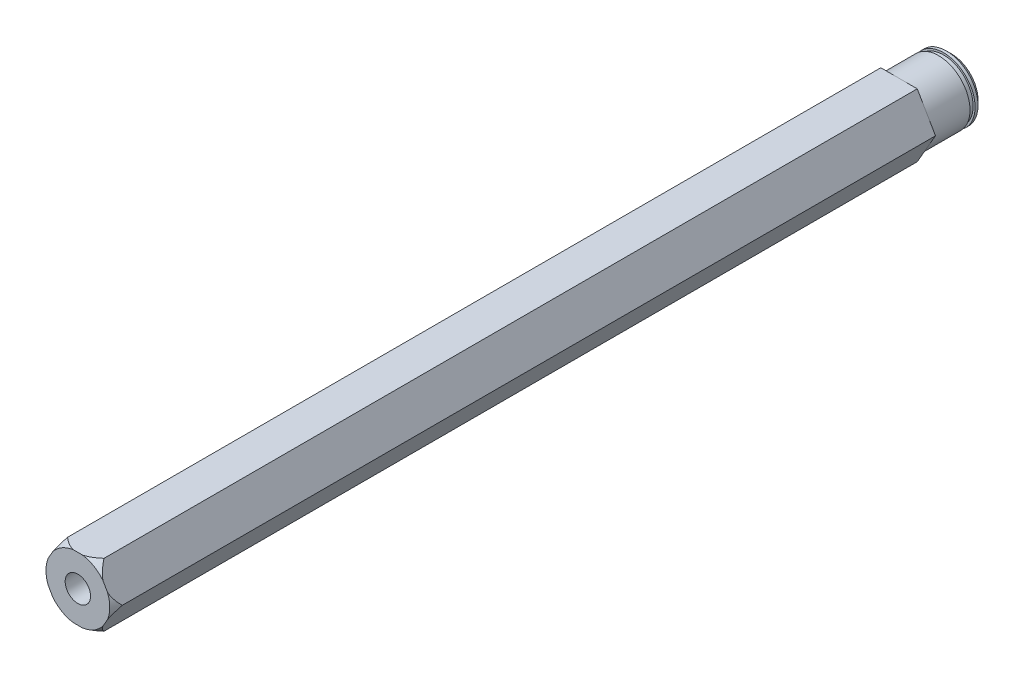
ISO-10303-21;
HEADER;
FILE_DESCRIPTION(('STEP AP214'),'2;1');
FILE_NAME('part.step','',(''),(''),'','','');
FILE_SCHEMA(('AUTOMOTIVE_DESIGN { 1 0 10303 214 1 1 1 1 }'));
ENDSEC;
DATA;
#1=APPLICATION_CONTEXT('core data for automotive mechanical design processes');
#2=APPLICATION_PROTOCOL_DEFINITION('international standard','automotive_design',2000,#1);
#3=PRODUCT_CONTEXT('',#1,'mechanical');
#4=PRODUCT('Part','Part','',(#3));
#5=PRODUCT_RELATED_PRODUCT_CATEGORY('part','',(#4));
#6=PRODUCT_DEFINITION_FORMATION('','',#4);
#7=PRODUCT_DEFINITION_CONTEXT('part definition',#1,'design');
#8=PRODUCT_DEFINITION('design','',#6,#7);
#9=PRODUCT_DEFINITION_SHAPE('','',#8);
#10=(LENGTH_UNIT() NAMED_UNIT(*) SI_UNIT(.MILLI.,.METRE.));
#11=(NAMED_UNIT(*) PLANE_ANGLE_UNIT() SI_UNIT($,.RADIAN.));
#12=(NAMED_UNIT(*) SI_UNIT($,.STERADIAN.) SOLID_ANGLE_UNIT());
#13=UNCERTAINTY_MEASURE_WITH_UNIT(LENGTH_MEASURE(1.E-05),#10,'distance_accuracy_value','');
#14=(GEOMETRIC_REPRESENTATION_CONTEXT(3) GLOBAL_UNCERTAINTY_ASSIGNED_CONTEXT((#13)) GLOBAL_UNIT_ASSIGNED_CONTEXT((#10,
#11,#12)) REPRESENTATION_CONTEXT('',''));
#15=CARTESIAN_POINT('',(0.,0.,0.));
#16=DIRECTION('',(0.,0.,1.));
#17=DIRECTION('',(1.,0.,0.));
#18=AXIS2_PLACEMENT_3D('',#15,#16,#17);
#19=CARTESIAN_POINT('',(0.,0.,-80.3909999999064));
#20=DIRECTION('',(0.,0.,-1.));
#21=DIRECTION('',(-1.,0.,0.));
#22=AXIS2_PLACEMENT_3D('',#19,#20,#21);
#23=CONICAL_SURFACE('',#22,3.18769999989854,1.02974425864327);
#24=CARTESIAN_POINT('',(1.13686837721616E-10,0.,-78.4756366047077));
#25=VERTEX_POINT('',#24);
#26=VERTEX_LOOP('',#25);
#27=FACE_BOUND('',#26,.T.);
#28=CARTESIAN_POINT('',(0.,0.,-80.391));
#29=DIRECTION('',(0.,0.,-1.));
#30=DIRECTION('',(-1.,0.,0.));
#31=AXIS2_PLACEMENT_3D('',#28,#29,#30);
#32=CIRCLE('',#31,3.1877);
#33=CARTESIAN_POINT('',(-3.1877,0.,-80.391));
#34=VERTEX_POINT('',#33);
#35=EDGE_CURVE('E114',#34,#34,#32,.T.);
#36=ORIENTED_EDGE('',*,*,#35,.T.);
#37=EDGE_LOOP('',(#36));
#38=FACE_BOUND('',#37,.T.);
#39=ADVANCED_FACE('F16',(#27,#38),#23,.F.);
#40=CARTESIAN_POINT('',(0.,0.,-93.091));
#41=DIRECTION('',(0.,0.,-1.));
#42=DIRECTION('',(-1.,0.,0.));
#43=AXIS2_PLACEMENT_3D('',#40,#41,#42);
#44=CYLINDRICAL_SURFACE('',#43,3.1877);
#45=CARTESIAN_POINT('',(0.,0.,-93.091));
#46=DIRECTION('',(0.,0.,-1.));
#47=DIRECTION('',(-1.,0.,0.));
#48=AXIS2_PLACEMENT_3D('',#45,#46,#47);
#49=CIRCLE('',#48,3.1877);
#50=CARTESIAN_POINT('',(-3.1877,0.,-93.091));
#51=VERTEX_POINT('',#50);
#52=EDGE_CURVE('E19',#51,#51,#49,.F.);
#53=ORIENTED_EDGE('',*,*,#52,.F.);
#54=EDGE_LOOP('',(#53));
#55=FACE_BOUND('',#54,.T.);
#56=ORIENTED_EDGE('',*,*,#35,.F.);
#57=EDGE_LOOP('',(#56));
#58=FACE_BOUND('',#57,.T.);
#59=ADVANCED_FACE('F111',(#55,#58),#44,.F.);
#60=CARTESIAN_POINT('',(0.,0.,-93.091));
#61=DIRECTION('',(0.,0.,-1.));
#62=DIRECTION('',(-1.,0.,0.));
#63=AXIS2_PLACEMENT_3D('',#60,#61,#62);
#64=PLANE('',#63);
#65=ORIENTED_EDGE('',*,*,#52,.T.);
#66=EDGE_LOOP('',(#65));
#67=FACE_BOUND('',#66,.T.);
#68=CARTESIAN_POINT('',(0.,0.,-93.0910000000722));
#69=DIRECTION('',(0.,0.,1.));
#70=DIRECTION('',(1.,0.,0.));
#71=AXIS2_PLACEMENT_3D('',#68,#69,#70);
#72=CIRCLE('',#71,5.33730000000787);
#73=CARTESIAN_POINT('',(5.33730000000787,0.,-93.0910000000722));
#74=VERTEX_POINT('',#73);
#75=EDGE_CURVE('E118',#74,#74,#72,.T.);
#76=ORIENTED_EDGE('',*,*,#75,.F.);
#77=EDGE_LOOP('',(#76));
#78=FACE_BOUND('',#77,.T.);
#79=ADVANCED_FACE('F323',(#67,#78),#64,.T.);
#80=CARTESIAN_POINT('',(0.,0.,-92.091000000039));
#81=DIRECTION('',(0.,0.,1.));
#82=DIRECTION('',(1.,0.,0.));
#83=AXIS2_PLACEMENT_3D('',#80,#81,#82);
#84=CONICAL_SURFACE('',#83,6.33729999998422,0.785398163369027);
#85=ORIENTED_EDGE('',*,*,#75,.T.);
#86=EDGE_LOOP('',(#85));
#87=FACE_BOUND('',#86,.T.);
#88=CARTESIAN_POINT('',(0.,0.,-92.091));
#89=DIRECTION('',(0.,0.,1.));
#90=DIRECTION('',(1.,0.,0.));
#91=AXIS2_PLACEMENT_3D('',#88,#89,#90);
#92=CIRCLE('',#91,6.3373);
#93=CARTESIAN_POINT('',(6.3373,0.,-92.091));
#94=VERTEX_POINT('',#93);
#95=EDGE_CURVE('E121',#94,#94,#92,.T.);
#96=ORIENTED_EDGE('',*,*,#95,.F.);
#97=EDGE_LOOP('',(#96));
#98=FACE_BOUND('',#97,.T.);
#99=ADVANCED_FACE('F321',(#87,#98),#84,.T.);
#100=CARTESIAN_POINT('',(0.,0.,-93.091));
#101=DIRECTION('',(0.,0.,1.));
#102=DIRECTION('',(1.,0.,0.));
#103=AXIS2_PLACEMENT_3D('',#100,#101,#102);
#104=CYLINDRICAL_SURFACE('',#103,6.3373);
#105=ORIENTED_EDGE('',*,*,#95,.T.);
#106=EDGE_LOOP('',(#105));
#107=FACE_BOUND('',#106,.T.);
#108=CARTESIAN_POINT('',(0.,0.,-91.5035));
#109=DIRECTION('',(0.,0.,1.));
#110=DIRECTION('',(1.,0.,0.));
#111=AXIS2_PLACEMENT_3D('',#108,#109,#110);
#112=CIRCLE('',#111,6.3373);
#113=CARTESIAN_POINT('',(6.3373,0.,-91.5035));
#114=VERTEX_POINT('',#113);
#115=EDGE_CURVE('E310',#114,#114,#112,.F.);
#116=ORIENTED_EDGE('',*,*,#115,.T.);
#117=EDGE_LOOP('',(#116));
#118=FACE_BOUND('',#117,.T.);
#119=ADVANCED_FACE('F318',(#107,#118),#104,.T.);
#120=CARTESIAN_POINT('',(0.,0.,-91.5035));
#121=DIRECTION('',(0.,0.,-1.));
#122=DIRECTION('',(-1.,0.,0.));
#123=AXIS2_PLACEMENT_3D('',#120,#121,#122);
#124=PLANE('',#123);
#125=CARTESIAN_POINT('',(0.,0.,-91.5035));
#126=DIRECTION('',(0.,0.,1.));
#127=DIRECTION('',(1.,0.,0.));
#128=AXIS2_PLACEMENT_3D('',#125,#126,#127);
#129=CIRCLE('',#128,5.9436);
#130=CARTESIAN_POINT('',(5.9436,0.,-91.5035));
#131=VERTEX_POINT('',#130);
#132=EDGE_CURVE('E299',#131,#131,#129,.T.);
#133=ORIENTED_EDGE('',*,*,#132,.F.);
#134=EDGE_LOOP('',(#133));
#135=FACE_BOUND('',#134,.T.);
#136=ORIENTED_EDGE('',*,*,#115,.F.);
#137=EDGE_LOOP('',(#136));
#138=FACE_BOUND('',#137,.T.);
#139=ADVANCED_FACE('F329',(#135,#138),#124,.F.);
#140=CARTESIAN_POINT('',(0.,0.,-91.5035));
#141=DIRECTION('',(0.,0.,1.));
#142=DIRECTION('',(1.,0.,0.));
#143=AXIS2_PLACEMENT_3D('',#140,#141,#142);
#144=CYLINDRICAL_SURFACE('',#143,5.9436);
#145=CARTESIAN_POINT('',(0.,0.,-90.4875));
#146=DIRECTION('',(0.,0.,1.));
#147=DIRECTION('',(1.,0.,0.));
#148=AXIS2_PLACEMENT_3D('',#145,#146,#147);
#149=CIRCLE('',#148,5.9436);
#150=CARTESIAN_POINT('',(5.9436,0.,-90.4875));
#151=VERTEX_POINT('',#150);
#152=EDGE_CURVE('E294',#151,#151,#149,.T.);
#153=ORIENTED_EDGE('',*,*,#152,.F.);
#154=EDGE_LOOP('',(#153));
#155=FACE_BOUND('',#154,.T.);
#156=ORIENTED_EDGE('',*,*,#132,.T.);
#157=EDGE_LOOP('',(#156));
#158=FACE_BOUND('',#157,.T.);
#159=ADVANCED_FACE('F371',(#155,#158),#144,.T.);
#160=CARTESIAN_POINT('',(0.,0.,-90.4875));
#161=DIRECTION('',(0.,0.,-1.));
#162=DIRECTION('',(-1.,0.,0.));
#163=AXIS2_PLACEMENT_3D('',#160,#161,#162);
#164=PLANE('',#163);
#165=ORIENTED_EDGE('',*,*,#152,.T.);
#166=EDGE_LOOP('',(#165));
#167=FACE_BOUND('',#166,.T.);
#168=CARTESIAN_POINT('',(0.,0.,-90.4875));
#169=DIRECTION('',(0.,0.,1.));
#170=DIRECTION('',(1.,0.,0.));
#171=AXIS2_PLACEMENT_3D('',#168,#169,#170);
#172=CIRCLE('',#171,6.3373);
#173=CARTESIAN_POINT('',(6.3373,0.,-90.4875));
#174=VERTEX_POINT('',#173);
#175=EDGE_CURVE('E289',#174,#174,#172,.T.);
#176=ORIENTED_EDGE('',*,*,#175,.F.);
#177=EDGE_LOOP('',(#176));
#178=FACE_BOUND('',#177,.T.);
#179=ADVANCED_FACE('F380',(#167,#178),#164,.T.);
#180=CARTESIAN_POINT('',(0.,0.,31.7499999999882));
#181=DIRECTION('',(0.,0.,1.));
#182=DIRECTION('',(1.,0.,0.));
#183=AXIS2_PLACEMENT_3D('',#180,#181,#182);
#184=CONICAL_SURFACE('',#183,2.55270000008068,1.02974425865501);
#185=CARTESIAN_POINT('',(-5.6843418860808E-11,0.,30.2161830977354));
#186=VERTEX_POINT('',#185);
#187=VERTEX_LOOP('',#186);
#188=FACE_BOUND('',#187,.T.);
#189=CARTESIAN_POINT('',(0.,0.,31.75));
#190=DIRECTION('',(0.,0.,1.));
#191=DIRECTION('',(1.,0.,0.));
#192=AXIS2_PLACEMENT_3D('',#189,#190,#191);
#193=CIRCLE('',#192,2.55269999999999);
#194=CARTESIAN_POINT('',(2.55269999999999,0.,31.75));
#195=VERTEX_POINT('',#194);
#196=EDGE_CURVE('E287',#195,#195,#193,.T.);
#197=ORIENTED_EDGE('',*,*,#196,.T.);
#198=EDGE_LOOP('',(#197));
#199=FACE_BOUND('',#198,.T.);
#200=ADVANCED_FACE('F390',(#188,#199),#184,.F.);
#201=CARTESIAN_POINT('',(0.,0.,-90.4875));
#202=DIRECTION('',(0.,0.,1.));
#203=DIRECTION('',(1.,0.,0.));
#204=AXIS2_PLACEMENT_3D('',#201,#202,#203);
#205=CYLINDRICAL_SURFACE('',#204,6.3373);
#206=ORIENTED_EDGE('',*,*,#175,.T.);
#207=EDGE_LOOP('',(#206));
#208=FACE_BOUND('',#207,.T.);
#209=CARTESIAN_POINT('',(0.,0.,-82.55));
#210=DIRECTION('',(0.,0.,1.));
#211=DIRECTION('',(1.,0.,0.));
#212=AXIS2_PLACEMENT_3D('',#209,#210,#211);
#213=CIRCLE('',#212,6.3373);
#214=CARTESIAN_POINT('',(6.3373,0.,-82.55));
#215=VERTEX_POINT('',#214);
#216=EDGE_CURVE('E260',#215,#215,#213,.F.);
#217=ORIENTED_EDGE('',*,*,#216,.T.);
#218=EDGE_LOOP('',(#217));
#219=FACE_BOUND('',#218,.T.);
#220=ADVANCED_FACE('F400',(#208,#219),#205,.T.);
#221=CARTESIAN_POINT('',(0.,0.,82.55));
#222=DIRECTION('',(0.,0.,1.));
#223=DIRECTION('',(1.,0.,0.));
#224=AXIS2_PLACEMENT_3D('',#221,#222,#223);
#225=CYLINDRICAL_SURFACE('',#224,2.55269999999999);
#226=CARTESIAN_POINT('',(0.,0.,82.55));
#227=DIRECTION('',(0.,0.,1.));
#228=DIRECTION('',(1.,0.,0.));
#229=AXIS2_PLACEMENT_3D('',#226,#227,#228);
#230=CIRCLE('',#229,2.55269999999999);
#231=CARTESIAN_POINT('',(2.55269999999999,0.,82.55));
#232=VERTEX_POINT('',#231);
#233=EDGE_CURVE('E178',#232,#232,#230,.F.);
#234=ORIENTED_EDGE('',*,*,#233,.F.);
#235=EDGE_LOOP('',(#234));
#236=FACE_BOUND('',#235,.T.);
#237=ORIENTED_EDGE('',*,*,#196,.F.);
#238=EDGE_LOOP('',(#237));
#239=FACE_BOUND('',#238,.T.);
#240=ADVANCED_FACE('F409',(#236,#239),#225,.F.);
#241=CARTESIAN_POINT('',(0.,0.,80.95297503138));
#242=DIRECTION('',(0.,0.,-1.));
#243=DIRECTION('',(-1.,0.,0.));
#244=AXIS2_PLACEMENT_3D('',#241,#242,#243);
#245=CONICAL_SURFACE('',#244,7.33784766197232,0.523598775599157);
#246=CARTESIAN_POINT('',(0.,0.,82.5500000000261));
#247=DIRECTION('',(0.,0.,-1.));
#248=DIRECTION('',(-1.,0.,0.));
#249=AXIS2_PLACEMENT_3D('',#246,#247,#248);
#250=CIRCLE('',#249,6.41580486642011);
#251=CARTESIAN_POINT('',(5.95753309029521,-2.38124999983591,82.5500000000665));
#252=VERTEX_POINT('',#251);
#253=CARTESIAN_POINT('',(5.95753309029522,2.38124999983588,82.5500000000665));
#254=VERTEX_POINT('',#253);
#255=EDGE_CURVE('E172',#252,#254,#250,.F.);
#256=ORIENTED_EDGE('',*,*,#255,.F.);
#257=CARTESIAN_POINT('',(5.9575330902072,-2.38124999997401,82.5500000001049));
#258=CARTESIAN_POINT('',(6.04768464475631,-2.22510292712283,82.5054206228411));
#259=CARTESIAN_POINT('',(6.13607788133945,-2.07200135031914,82.4487424459395));
#260=CARTESIAN_POINT('',(6.30872459605968,-1.77296846866658,82.3158785324575));
#261=CARTESIAN_POINT('',(6.39299422033064,-1.62700919789353,82.2397776054735));
#262=CARTESIAN_POINT('',(6.55630662291236,-1.34414381911513,82.0735641086016));
#263=CARTESIAN_POINT('',(6.6354091132049,-1.2071342869235,81.9836804719181));
#264=CARTESIAN_POINT('',(6.79011042275309,-0.93918375878879,81.7923542039698));
#265=CARTESIAN_POINT('',(6.86570588249394,-0.808248581696028,81.6909007986184));
#266=CARTESIAN_POINT('',(7.00739272312851,-0.562839774952995,81.4881291258003));
#267=CARTESIAN_POINT('',(7.07374565541032,-0.447913125009723,81.3875329759745));
#268=CARTESIAN_POINT('',(7.2045423834658,-0.221366546553902,81.1795927513426));
#269=CARTESIAN_POINT('',(7.26896900512523,-0.109776364479766,81.0722053274823));
#270=CARTESIAN_POINT('',(7.33234841873697,4.9729793182415E-11,80.9625000000668));
#271=B_SPLINE_CURVE_WITH_KNOTS('',3,(#257,#258,#259,#260,#261,#262,#263,#264,#265,#266,#267,
#268,#269,#270),.UNSPECIFIED.,.F.,.F.,(4,2,2,2,2,2,4),(0.,0.556041338597268,1.10969506132446,
1.65498842191831,2.20079378630624,2.70018644916796,3.20317275083286),.UNSPECIFIED.);
#272=CARTESIAN_POINT('',(7.33234841872268,-2.49558516937748E-11,80.9625000000915));
#273=VERTEX_POINT('',#272);
#274=EDGE_CURVE('E265',#252,#273,#271,.T.);
#275=ORIENTED_EDGE('',*,*,#274,.T.);
#276=CARTESIAN_POINT('',(7.33234841872844,-5.24179489744612E-11,80.9625000000641));
#277=CARTESIAN_POINT('',(7.29299664468391,0.0681592719717019,81.0306518988116));
#278=CARTESIAN_POINT('',(7.25324219517879,0.137015998346176,81.0978708581296));
#279=CARTESIAN_POINT('',(7.17283547695063,0.276284519590754,81.2301772694211));
#280=CARTESIAN_POINT('',(7.13218292044743,0.346696812910709,81.2952640210858));
#281=CARTESIAN_POINT('',(7.00833854929923,0.561201555968957,81.4875438974126));
#282=CARTESIAN_POINT('',(6.92367886982141,0.707836422177948,81.6110219461014));
#283=CARTESIAN_POINT('',(6.75215410450158,1.00492603046887,81.8416963128609));
#284=CARTESIAN_POINT('',(6.66540498850714,1.15517990688269,81.9492345618961));
#285=CARTESIAN_POINT('',(6.48736515971425,1.46355393612267,82.1473477682195));
#286=CARTESIAN_POINT('',(6.3960862846916,1.6216535853197,82.2379642687729));
#287=CARTESIAN_POINT('',(6.24676379623667,1.88028772203629,82.3648131644211));
#288=CARTESIAN_POINT('',(6.19024220772766,1.97818598505839,82.4082029409433));
#289=CARTESIAN_POINT('',(6.0752356281551,2.17738322408277,82.4861906915612));
#290=CARTESIAN_POINT('',(6.01673906487265,2.27870224375613,82.5207200657749));
#291=CARTESIAN_POINT('',(5.95753309021381,2.38124999997688,82.5500000001068));
#292=B_SPLINE_CURVE_WITH_KNOTS('',3,(#276,#277,#278,#279,#280,#281,#282,#283,#284,#285,#286,
#287,#288,#289,#290,#291),.UNSPECIFIED.,.F.,.F.,(4,2,2,2,2,2,2,4),(0.,0.312314714597514,
0.624730998804346,1.25290159629267,1.86460708727271,2.47479049590191,2.83769546790975,
3.20333070793349),.UNSPECIFIED.);
#293=EDGE_CURVE('E94',#273,#254,#292,.T.);
#294=ORIENTED_EDGE('',*,*,#293,.T.);
#295=EDGE_LOOP('',(#256,#275,#294));
#296=FACE_BOUND('',#295,.T.);
#297=ADVANCED_FACE('F419',(#296),#245,.T.);
#298=CARTESIAN_POINT('',(7.33234841870826,0.,82.55));
#299=DIRECTION('',(-0.866025403784439,-0.5,0.));
#300=DIRECTION('',(0.5,-0.866025403784439,0.));
#301=AXIS2_PLACEMENT_3D('',#298,#299,#300);
#302=PLANE('',#301);
#303=CARTESIAN_POINT('',(5.04098953784292,3.96875000001962,82.5500000001049));
#304=CARTESIAN_POINT('',(4.95083798330792,4.12489707286411,82.505420622845));
#305=CARTESIAN_POINT('',(4.86244474673392,4.27799864965921,82.4487424459492));
#306=CARTESIAN_POINT('',(4.68979803202495,4.57703153129754,82.3158785324798));
#307=CARTESIAN_POINT('',(4.60552840775623,4.72299080206477,82.239777605502));
#308=CARTESIAN_POINT('',(4.44221600517122,5.00585618084748,82.0735641086346));
#309=CARTESIAN_POINT('',(4.36311351487355,5.14286571304852,81.9836804719477));
#310=CARTESIAN_POINT('',(4.2084122053167,5.4108162411986,81.7923542039944));
#311=CARTESIAN_POINT('',(4.13281674557222,5.5417514182975,81.6909007986416));
#312=CARTESIAN_POINT('',(3.99112990938512,5.78716021733721,81.4881291321894));
#313=CARTESIAN_POINT('',(3.92477698137733,5.90208685987767,81.3875329892195));
#314=CARTESIAN_POINT('',(3.79398026164034,6.1286334239255,81.1795927791106));
#315=CARTESIAN_POINT('',(3.72955364402199,6.24022359900031,81.0722053629258));
#316=CARTESIAN_POINT('',(3.66617423433126,6.34999995673834,80.9625000434085));
#317=B_SPLINE_CURVE_WITH_KNOTS('',3,(#303,#304,#305,#306,#307,#308,#309,#310,#311,#312,#313,
#314,#315,#316),.UNSPECIFIED.,.F.,.F.,(4,2,2,2,2,2,4),(0.,0.556041338557675,1.10969506126038,
1.65498842188743,2.20079378629383,2.70018641633068,3.20317268467311),.UNSPECIFIED.);
#318=CARTESIAN_POINT('',(5.04098953774066,3.96875000021005,82.5500000000533));
#319=VERTEX_POINT('',#318);
#320=CARTESIAN_POINT('',(3.66617421830183,6.34999997836934,80.9625000248438));
#321=VERTEX_POINT('',#320);
#322=EDGE_CURVE('E277',#319,#321,#317,.T.);
#323=ORIENTED_EDGE('',*,*,#322,.F.);
#324=DIRECTION('',(-0.5,0.866025403784438,0.));
#325=VECTOR('',#324,1.);
#326=CARTESIAN_POINT('',(5.95753309020036,2.38125000000017,82.55));
#327=LINE('',#326,#325);
#328=EDGE_CURVE('E171',#254,#319,#327,.T.);
#329=ORIENTED_EDGE('',*,*,#328,.F.);
#330=ORIENTED_EDGE('',*,*,#293,.F.);
#331=DIRECTION('',(0.,0.,1.));
#332=VECTOR('',#331,1.);
#333=CARTESIAN_POINT('',(7.33234841870827,0.,82.55));
#334=LINE('',#333,#332);
#335=CARTESIAN_POINT('',(7.33234841870826,0.,-82.55));
#336=VERTEX_POINT('',#335);
#337=EDGE_CURVE('E99',#273,#336,#334,.F.);
#338=ORIENTED_EDGE('',*,*,#337,.T.);
#339=DIRECTION('',(-0.5,0.866025403784438,0.));
#340=VECTOR('',#339,1.);
#341=CARTESIAN_POINT('',(7.33234841870826,0.,-82.55));
#342=LINE('',#341,#340);
#343=CARTESIAN_POINT('',(3.66617420935413,6.35000000000001,-82.55));
#344=VERTEX_POINT('',#343);
#345=EDGE_CURVE('E270',#336,#344,#342,.T.);
#346=ORIENTED_EDGE('',*,*,#345,.T.);
#347=DIRECTION('',(0.,0.,1.));
#348=VECTOR('',#347,1.);
#349=CARTESIAN_POINT('',(3.66617420935413,6.35000000000001,82.55));
#350=LINE('',#349,#348);
#351=EDGE_CURVE('E273',#344,#321,#350,.T.);
#352=ORIENTED_EDGE('',*,*,#351,.T.);
#353=EDGE_LOOP('',(#323,#329,#330,#338,#346,#352));
#354=FACE_BOUND('',#353,.T.);
#355=ADVANCED_FACE('F430',(#354),#302,.F.);
#356=CARTESIAN_POINT('',(0.,0.,80.9529750316074));
#357=DIRECTION('',(0.,0.,-1.));
#358=DIRECTION('',(-1.,0.,0.));
#359=AXIS2_PLACEMENT_3D('',#356,#357,#358);
#360=CONICAL_SURFACE('',#359,7.33784766185863,0.523598775607416);
#361=ORIENTED_EDGE('',*,*,#322,.T.);
#362=CARTESIAN_POINT('',(3.6661742022726,6.35000000000001,80.9625000062796));
#363=CARTESIAN_POINT('',(3.58747065415635,6.35000000000001,81.0306519049388));
#364=CARTESIAN_POINT('',(3.5079617551239,6.35000000000001,81.0978708641664));
#365=CARTESIAN_POINT('',(3.34714831862595,6.35000000000001,81.2301772752712));
#366=CARTESIAN_POINT('',(3.26584320560015,6.35000000000001,81.2952640268397));
#367=CARTESIAN_POINT('',(3.0181544632345,6.35000000000001,81.4875439028682));
#368=CARTESIAN_POINT('',(2.84883510422279,6.35000000000001,81.6110219513422));
#369=CARTESIAN_POINT('',(2.50578557346771,6.35000000000001,81.8416963176312));
#370=CARTESIAN_POINT('',(2.33228734141988,6.35000000000001,81.9492345664121));
#371=CARTESIAN_POINT('',(1.97620768371601,6.35000000000001,82.1473477721709));
#372=CARTESIAN_POINT('',(1.79364993361174,6.35000000000001,82.2379642724144));
#373=CARTESIAN_POINT('',(1.4950049578594,6.35000000000001,82.364813166993));
#374=CARTESIAN_POINT('',(1.38196178208826,6.35000000000001,82.408202942863));
#375=CARTESIAN_POINT('',(1.15194862553043,6.35000000000001,82.4861906923641));
#376=CARTESIAN_POINT('',(1.03495550030675,6.35000000000001,82.5207200661153));
#377=CARTESIAN_POINT('',(0.916543552365276,6.35000000000001,82.5500000001067));
#378=B_SPLINE_CURVE_WITH_KNOTS('',3,(#362,#363,#364,#365,#366,#367,#368,#369,#370,#371,#372,
#373,#374,#375,#376,#377),.UNSPECIFIED.,.F.,.F.,(4,2,2,2,2,2,2,4),(0.,0.312314714463972,
0.624730998537973,1.25290159577759,1.86460708650327,2.4747904948688,2.8376954626947,
3.20333069847635),.UNSPECIFIED.);
#379=CARTESIAN_POINT('',(0.916543552528099,6.35,82.5500000000665));
#380=VERTEX_POINT('',#379);
#381=EDGE_CURVE('E276',#321,#380,#378,.T.);
#382=ORIENTED_EDGE('',*,*,#381,.T.);
#383=CARTESIAN_POINT('',(0.,0.,82.5500000000261));
#384=DIRECTION('',(0.,0.,-1.));
#385=DIRECTION('',(-1.,0.,0.));
#386=AXIS2_PLACEMENT_3D('',#383,#384,#385);
#387=CIRCLE('',#386,6.41580486642011);
#388=EDGE_CURVE('E169',#319,#380,#387,.F.);
#389=ORIENTED_EDGE('',*,*,#388,.F.);
#390=EDGE_LOOP('',(#361,#382,#389));
#391=FACE_BOUND('',#390,.T.);
#392=ADVANCED_FACE('F439',(#391),#360,.T.);
#393=CARTESIAN_POINT('',(3.66617420935413,6.35000000000001,82.55));
#394=DIRECTION('',(0.,-1.,0.));
#395=DIRECTION('',(1.,0.,0.));
#396=AXIS2_PLACEMENT_3D('',#393,#394,#395);
#397=PLANE('',#396);
#398=CARTESIAN_POINT('',(-0.916543552365067,6.34999999999335,82.5500000001049));
#399=CARTESIAN_POINT('',(-1.09684666145357,6.34999999999762,82.5054206228414));
#400=CARTESIAN_POINT('',(-1.27363313461495,6.34999999999937,82.4487424459404));
#401=CARTESIAN_POINT('',(-1.61892656405062,6.35000000000064,82.3158785324597));
#402=CARTESIAN_POINT('',(-1.78746581259258,6.35000000000018,82.2397776054763));
#403=CARTESIAN_POINT('',(-2.11409061775746,6.34999999999984,82.0735641086045));
#404=CARTESIAN_POINT('',(-2.27229559834384,6.34999999999996,81.9836804719203));
#405=CARTESIAN_POINT('',(-2.58169821744255,6.35000000000005,81.7923542039706));
#406=CARTESIAN_POINT('',(-2.73288913692532,6.35000000000002,81.6909007986187));
#407=CARTESIAN_POINT('',(-3.01626281692241,6.35,81.4881291267104));
#408=CARTESIAN_POINT('',(-3.14896868026358,6.35,81.3875329778648));
#409=CARTESIAN_POINT('',(-3.41056213399526,6.35000000000001,81.1795927553092));
#410=CARTESIAN_POINT('',(-3.53941537615828,6.35000000000002,81.0722053325463));
#411=CARTESIAN_POINT('',(-3.66617420226029,6.35000000000001,80.96250000626));
#412=B_SPLINE_CURVE_WITH_KNOTS('',3,(#398,#399,#400,#401,#402,#403,#404,#405,#406,#407,#408,
#409,#410,#411),.UNSPECIFIED.,.F.,.F.,(4,2,2,2,2,2,4),(0.,0.556041338592067,1.1096950613162,
1.65498842191523,2.20079378630623,2.70018644447423,3.20317274137428),.UNSPECIFIED.);
#413=CARTESIAN_POINT('',(-0.91654355258112,6.35,82.5500000000533));
#414=VERTEX_POINT('',#413);
#415=CARTESIAN_POINT('',(-3.66617420604704,6.34999999958475,80.9625000036034));
#416=VERTEX_POINT('',#415);
#417=EDGE_CURVE('E547',#414,#416,#412,.T.);
#418=ORIENTED_EDGE('',*,*,#417,.F.);
#419=DIRECTION('',(1.,0.,0.));
#420=VECTOR('',#419,1.);
#421=CARTESIAN_POINT('',(0.,6.35,82.55));
#422=LINE('',#421,#420);
#423=EDGE_CURVE('E168',#380,#414,#422,.F.);
#424=ORIENTED_EDGE('',*,*,#423,.F.);
#425=ORIENTED_EDGE('',*,*,#381,.F.);
#426=ORIENTED_EDGE('',*,*,#351,.F.);
#427=DIRECTION('',(1.,0.,0.));
#428=VECTOR('',#427,1.);
#429=CARTESIAN_POINT('',(0.,6.35000000000001,-82.55));
#430=LINE('',#429,#428);
#431=CARTESIAN_POINT('',(-3.66617420935412,6.35000000000001,-82.55));
#432=VERTEX_POINT('',#431);
#433=EDGE_CURVE('E280',#344,#432,#430,.F.);
#434=ORIENTED_EDGE('',*,*,#433,.T.);
#435=DIRECTION('',(0.,0.,1.));
#436=VECTOR('',#435,1.);
#437=CARTESIAN_POINT('',(-3.66617420935412,6.35000000000001,82.55));
#438=LINE('',#437,#436);
#439=EDGE_CURVE('E252',#432,#416,#438,.T.);
#440=ORIENTED_EDGE('',*,*,#439,.T.);
#441=EDGE_LOOP('',(#418,#424,#425,#426,#434,#440));
#442=FACE_BOUND('',#441,.T.);
#443=ADVANCED_FACE('F447',(#442),#397,.F.);
#444=CARTESIAN_POINT('',(0.,0.,80.95297503138));
#445=DIRECTION('',(0.,0.,-1.));
#446=DIRECTION('',(-1.,0.,0.));
#447=AXIS2_PLACEMENT_3D('',#444,#445,#446);
#448=CONICAL_SURFACE('',#447,7.33784766197232,0.523598775599157);
#449=CARTESIAN_POINT('',(0.,0.,82.5500000000261));
#450=DIRECTION('',(0.,0.,-1.));
#451=DIRECTION('',(-1.,0.,0.));
#452=AXIS2_PLACEMENT_3D('',#449,#450,#451);
#453=CIRCLE('',#452,6.41580486642011);
#454=CARTESIAN_POINT('',(-5.04098953776712,3.96875000016419,82.5500000000665));
#455=VERTEX_POINT('',#454);
#456=EDGE_CURVE('E166',#414,#455,#453,.F.);
#457=ORIENTED_EDGE('',*,*,#456,.F.);
#458=ORIENTED_EDGE('',*,*,#417,.T.);
#459=CARTESIAN_POINT('',(-3.66617420983362,6.34999999916949,80.962500000947));
#460=CARTESIAN_POINT('',(-3.70552598388472,6.28184072714502,81.0306518996808));
#461=CARTESIAN_POINT('',(-3.74528043339336,6.21298400076911,81.0978708589853));
#462=CARTESIAN_POINT('',(-3.82568715162592,6.07371547952046,81.2301772702501));
#463=CARTESIAN_POINT('',(-3.86633970812998,6.00330318619785,81.2952640219014));
#464=CARTESIAN_POINT('',(-3.99018407928225,5.7887984431307,81.4875438981864));
#465=CARTESIAN_POINT('',(-4.07484375876441,5.64216357691511,81.6110219468448));
#466=CARTESIAN_POINT('',(-4.24636852409267,5.34507396861023,81.8416963135378));
#467=CARTESIAN_POINT('',(-4.33311764009119,5.19482009218911,81.9492345625371));
#468=CARTESIAN_POINT('',(-4.51115746889239,4.88644606293456,82.1473477687807));
#469=CARTESIAN_POINT('',(-4.60243634391927,4.72834641373028,82.2379642692902));
#470=CARTESIAN_POINT('',(-4.75175883229186,4.46971227715635,82.3648131647866));
#471=CARTESIAN_POINT('',(-4.80828042071214,4.37181401428792,82.4082029412161));
#472=CARTESIAN_POINT('',(-4.9232870001006,4.17261677558241,82.4861906916753));
#473=CARTESIAN_POINT('',(-4.98178356328761,4.07129775607433,82.5207200658232));
#474=CARTESIAN_POINT('',(-5.04098953784854,3.96875000002318,82.5500000001068));
#475=B_SPLINE_CURVE_WITH_KNOTS('',3,(#459,#460,#461,#462,#463,#464,#465,#466,#467,#468,#469,
#470,#471,#472,#473,#474),.UNSPECIFIED.,.F.,.F.,(4,2,2,2,2,2,2,4),(0.,0.312314714578567,
0.624730998766603,1.25290159621983,1.86460708716402,2.47479049575602,2.83769546716885,
3.203330706589),.UNSPECIFIED.);
#476=EDGE_CURVE('E187',#416,#455,#475,.T.);
#477=ORIENTED_EDGE('',*,*,#476,.T.);
#478=EDGE_LOOP('',(#457,#458,#477));
#479=FACE_BOUND('',#478,.T.);
#480=ADVANCED_FACE('F457',(#479),#448,.T.);
#481=CARTESIAN_POINT('',(0.,0.,80.95297503138));
#482=DIRECTION('',(0.,0.,-1.));
#483=DIRECTION('',(-1.,0.,0.));
#484=AXIS2_PLACEMENT_3D('',#481,#482,#483);
#485=CONICAL_SURFACE('',#484,7.33784766197232,0.523598775599157);
#486=CARTESIAN_POINT('',(0.,0.,82.5500000000261));
#487=DIRECTION('',(0.,0.,-1.));
#488=DIRECTION('',(-1.,0.,0.));
#489=AXIS2_PLACEMENT_3D('',#486,#487,#488);
#490=CIRCLE('',#489,6.41580486642011);
#491=CARTESIAN_POINT('',(0.916543552527985,-6.35000000000002,82.5500000000665));
#492=VERTEX_POINT('',#491);
#493=CARTESIAN_POINT('',(5.04098953776719,-3.96875000016411,82.5500000000665));
#494=VERTEX_POINT('',#493);
#495=EDGE_CURVE('E176',#492,#494,#490,.F.);
#496=ORIENTED_EDGE('',*,*,#495,.F.);
#497=CARTESIAN_POINT('',(0.916543552364376,-6.34999999999286,82.5500000001049));
#498=CARTESIAN_POINT('',(1.09684666145463,-6.34999999999746,82.5054206228411));
#499=CARTESIAN_POINT('',(1.27363313461765,-6.34999999999934,82.4487424459395));
#500=CARTESIAN_POINT('',(1.61892656405576,-6.3500000000007,82.3158785324575));
#501=CARTESIAN_POINT('',(1.78746581259854,-6.3500000000002,82.2397776054735));
#502=CARTESIAN_POINT('',(2.11409061776261,-6.34999999999984,82.0735641086016));
#503=CARTESIAN_POINT('',(2.27229559834746,-6.34999999999997,81.9836804719181));
#504=CARTESIAN_POINT('',(2.58169821744367,-6.35000000000007,81.7923542039698));
#505=CARTESIAN_POINT('',(2.73288913692544,-6.35000000000003,81.6909007986184));
#506=CARTESIAN_POINT('',(3.01626281819462,-6.35000000000001,81.4881291258003));
#507=CARTESIAN_POINT('',(3.14896868275824,-6.35000000000001,81.3875329759745));
#508=CARTESIAN_POINT('',(3.41056213886918,-6.35000000000003,81.1795927513426));
#509=CARTESIAN_POINT('',(3.53941538218803,-6.35000000000003,81.0722053274823));
#510=CARTESIAN_POINT('',(3.66617420941156,-6.35000000000002,80.9625000000668));
#511=B_SPLINE_CURVE_WITH_KNOTS('',3,(#497,#498,#499,#500,#501,#502,#503,#504,#505,#506,#507,
#508,#509,#510),.UNSPECIFIED.,.F.,.F.,(4,2,2,2,2,2,4),(0.,0.556041338597272,1.10969506132447,
1.65498842191832,2.20079378630624,2.70018644916798,3.20317275083291),.UNSPECIFIED.);
#512=CARTESIAN_POINT('',(3.66617420933973,-6.35000000002498,80.9625000000915));
#513=VERTEX_POINT('',#512);
#514=EDGE_CURVE('E156',#492,#513,#511,.T.);
#515=ORIENTED_EDGE('',*,*,#514,.T.);
#516=CARTESIAN_POINT('',(3.66617420931883,-6.3500000000437,80.9625000000641));
#517=CARTESIAN_POINT('',(3.70552598337291,-6.28184072802509,81.0306518988116));
#518=CARTESIAN_POINT('',(3.74528043288208,-6.21298400165295,81.0978708581295));
#519=CARTESIAN_POINT('',(3.82568715111329,-6.07371548041014,81.2301772694211));
#520=CARTESIAN_POINT('',(3.86633970761549,-6.00330318708961,81.2952640210858));
#521=CARTESIAN_POINT('',(3.99018407876209,-5.78879844403044,81.4875438974126));
#522=CARTESIAN_POINT('',(4.0748437582407,-5.6421635778219,81.6110219461014));
#523=CARTESIAN_POINT('',(4.24636852356109,-5.3450739695313,81.8416963128609));
#524=CARTESIAN_POINT('',(4.33311763955532,-5.19482009311737,81.9492345618961));
#525=CARTESIAN_POINT('',(4.51115746834807,-4.88644606387731,82.1473477682195));
#526=CARTESIAN_POINT('',(4.60243634337078,-4.7283464146803,82.2379642687729));
#527=CARTESIAN_POINT('',(4.75175883182574,-4.46971227796372,82.3648131644211));
#528=CARTESIAN_POINT('',(4.80828042033475,-4.37181401494161,82.4082029409433));
#529=CARTESIAN_POINT('',(4.92328699990731,-4.17261677591722,82.4861906915612));
#530=CARTESIAN_POINT('',(4.98178356318975,-4.07129775624385,82.5207200657749));
#531=CARTESIAN_POINT('',(5.0409895378486,-3.9687500000231,82.5500000001068));
#532=B_SPLINE_CURVE_WITH_KNOTS('',3,(#516,#517,#518,#519,#520,#521,#522,#523,#524,#525,#526,
#527,#528,#529,#530,#531),.UNSPECIFIED.,.F.,.F.,(4,2,2,2,2,2,2,4),(0.,0.312314714597517,
0.62473099880434,1.25290159629266,1.8646070872727,2.47479049590191,2.83769546790977,
3.20333070793351),.UNSPECIFIED.);
#533=EDGE_CURVE('E541',#513,#494,#532,.T.);
#534=ORIENTED_EDGE('',*,*,#533,.T.);
#535=EDGE_LOOP('',(#496,#515,#534));
#536=FACE_BOUND('',#535,.T.);
#537=ADVANCED_FACE('F467',(#536),#485,.T.);
#538=CARTESIAN_POINT('',(3.66617420935413,-6.35000000000002,82.55));
#539=DIRECTION('',(-0.866025403784439,0.5,0.));
#540=DIRECTION('',(-0.5,-0.866025403784439,0.));
#541=AXIS2_PLACEMENT_3D('',#538,#539,#540);
#542=PLANE('',#541);
#543=ORIENTED_EDGE('',*,*,#274,.F.);
#544=DIRECTION('',(0.5,0.866025403784439,0.));
#545=VECTOR('',#544,1.);
#546=CARTESIAN_POINT('',(5.04098953786205,-3.96874999999981,82.55));
#547=LINE('',#546,#545);
#548=EDGE_CURVE('E175',#494,#252,#547,.T.);
#549=ORIENTED_EDGE('',*,*,#548,.F.);
#550=ORIENTED_EDGE('',*,*,#533,.F.);
#551=DIRECTION('',(0.,0.,1.));
#552=VECTOR('',#551,1.);
#553=CARTESIAN_POINT('',(3.66617420935415,-6.35000000000002,82.55));
#554=LINE('',#553,#552);
#555=CARTESIAN_POINT('',(3.66617420935414,-6.35000000000002,-82.55));
#556=VERTEX_POINT('',#555);
#557=EDGE_CURVE('E233',#513,#556,#554,.F.);
#558=ORIENTED_EDGE('',*,*,#557,.T.);
#559=DIRECTION('',(0.5,0.866025403784439,0.));
#560=VECTOR('',#559,1.);
#561=CARTESIAN_POINT('',(3.66617420935413,-6.35000000000002,-82.55));
#562=LINE('',#561,#560);
#563=EDGE_CURVE('E264',#556,#336,#562,.T.);
#564=ORIENTED_EDGE('',*,*,#563,.T.);
#565=ORIENTED_EDGE('',*,*,#337,.F.);
#566=EDGE_LOOP('',(#543,#549,#550,#558,#564,#565));
#567=FACE_BOUND('',#566,.T.);
#568=ADVANCED_FACE('F476',(#567),#542,.F.);
#569=CARTESIAN_POINT('',(0.,0.,-82.55));
#570=DIRECTION('',(0.,0.,1.));
#571=DIRECTION('',(1.,0.,0.));
#572=AXIS2_PLACEMENT_3D('',#569,#570,#571);
#573=PLANE('',#572);
#574=ORIENTED_EDGE('',*,*,#216,.F.);
#575=EDGE_LOOP('',(#574));
#576=FACE_BOUND('',#575,.T.);
#577=ORIENTED_EDGE('',*,*,#345,.F.);
#578=ORIENTED_EDGE('',*,*,#563,.F.);
#579=DIRECTION('',(-1.,0.,0.));
#580=VECTOR('',#579,1.);
#581=CARTESIAN_POINT('',(-3.6661742093541,-6.35000000000002,-82.55));
#582=LINE('',#581,#580);
#583=CARTESIAN_POINT('',(-3.6661742093541,-6.35000000000003,-82.55));
#584=VERTEX_POINT('',#583);
#585=EDGE_CURVE('E155',#556,#584,#582,.T.);
#586=ORIENTED_EDGE('',*,*,#585,.T.);
#587=DIRECTION('',(-0.5,0.866025403784439,0.));
#588=VECTOR('',#587,1.);
#589=CARTESIAN_POINT('',(-7.33234841870824,0.,-82.55));
#590=LINE('',#589,#588);
#591=CARTESIAN_POINT('',(-7.33234841870824,0.,-82.55));
#592=VERTEX_POINT('',#591);
#593=EDGE_CURVE('E230',#584,#592,#590,.T.);
#594=ORIENTED_EDGE('',*,*,#593,.T.);
#595=DIRECTION('',(0.5,0.866025403784439,0.));
#596=VECTOR('',#595,1.);
#597=CARTESIAN_POINT('',(-3.66617420935412,6.35000000000001,-82.55));
#598=LINE('',#597,#596);
#599=EDGE_CURVE('E255',#592,#432,#598,.T.);
#600=ORIENTED_EDGE('',*,*,#599,.T.);
#601=ORIENTED_EDGE('',*,*,#433,.F.);
#602=EDGE_LOOP('',(#577,#578,#586,#594,#600,#601));
#603=FACE_BOUND('',#602,.T.);
#604=ADVANCED_FACE('F207',(#576,#603),#573,.F.);
#605=CARTESIAN_POINT('',(-3.66617420935412,6.35000000000001,82.55));
#606=DIRECTION('',(0.866025403784439,-0.5,0.));
#607=DIRECTION('',(0.5,0.866025403784439,0.));
#608=AXIS2_PLACEMENT_3D('',#605,#606,#607);
#609=PLANE('',#608);
#610=CARTESIAN_POINT('',(-5.95753309020724,2.38124999997392,82.5500000001049));
#611=CARTESIAN_POINT('',(-6.04768464475607,2.22510292712321,82.5054206228418));
#612=CARTESIAN_POINT('',(-6.13607788133899,2.07200135031991,82.448742445941));
#613=CARTESIAN_POINT('',(-6.30872459605889,1.77296846866793,82.3158785324609));
#614=CARTESIAN_POINT('',(-6.39299422032973,1.62700919789509,82.239777605478));
#615=CARTESIAN_POINT('',(-6.55630662291131,1.34414381911692,82.0735641086083));
#616=CARTESIAN_POINT('',(-6.63540911320383,1.20713428692532,81.983680471926));
#617=CARTESIAN_POINT('',(-6.79011042275203,0.939183758790593,81.79235420398));
#618=CARTESIAN_POINT('',(-6.86570588249292,0.808248581697773,81.6909007986298));
#619=CARTESIAN_POINT('',(-7.00739272312611,0.562839774957128,81.4881291258162));
#620=CARTESIAN_POINT('',(-7.07374565540657,0.447913125016207,81.3875329759938));
#621=CARTESIAN_POINT('',(-7.20454238345942,0.221366546564916,81.179592751369));
#622=CARTESIAN_POINT('',(-7.26896900511759,0.109776364492958,81.0722053275124));
#623=CARTESIAN_POINT('',(-7.33234841872813,-3.44458761001832E-11,80.9625000001006));
#624=B_SPLINE_CURVE_WITH_KNOTS('',3,(#610,#611,#612,#613,#614,#615,#616,#617,#618,#619,#620,
#621,#622,#623),.UNSPECIFIED.,.F.,.F.,(4,2,2,2,2,2,4),(0.,0.556041338595253,1.1096950613205,
1.65498842191253,2.20079378629862,2.70018644914769,3.20317275079972),.UNSPECIFIED.);
#625=CARTESIAN_POINT('',(-5.95753309029525,2.38124999983581,82.5500000000665));
#626=VERTEX_POINT('',#625);
#627=CARTESIAN_POINT('',(-7.33234841870562,0.,80.9625000001688));
#628=VERTEX_POINT('',#627);
#629=EDGE_CURVE('E181',#626,#628,#624,.T.);
#630=ORIENTED_EDGE('',*,*,#629,.F.);
#631=DIRECTION('',(-0.499999999999999,-0.866025403784439,0.));
#632=VECTOR('',#631,1.);
#633=CARTESIAN_POINT('',(-5.04098953786199,3.96874999999989,82.55));
#634=LINE('',#633,#632);
#635=EDGE_CURVE('E165',#455,#626,#634,.T.);
#636=ORIENTED_EDGE('',*,*,#635,.F.);
#637=ORIENTED_EDGE('',*,*,#476,.F.);
#638=ORIENTED_EDGE('',*,*,#439,.F.);
#639=ORIENTED_EDGE('',*,*,#599,.F.);
#640=DIRECTION('',(0.,0.,1.));
#641=VECTOR('',#640,1.);
#642=CARTESIAN_POINT('',(-7.33234841870824,0.,82.55));
#643=LINE('',#642,#641);
#644=EDGE_CURVE('E224',#592,#628,#643,.T.);
#645=ORIENTED_EDGE('',*,*,#644,.T.);
#646=EDGE_LOOP('',(#630,#636,#637,#638,#639,#645));
#647=FACE_BOUND('',#646,.T.);
#648=ADVANCED_FACE('F193',(#647),#609,.F.);
#649=CARTESIAN_POINT('',(0.,0.,80.9529750002866));
#650=DIRECTION('',(0.,0.,-1.));
#651=DIRECTION('',(-1.,0.,0.));
#652=AXIS2_PLACEMENT_3D('',#649,#650,#651);
#653=CONICAL_SURFACE('',#652,7.33784767993484,0.523598775604213);
#654=CARTESIAN_POINT('',(0.,0.,82.5500000000261));
#655=DIRECTION('',(0.,0.,-1.));
#656=DIRECTION('',(-1.,0.,0.));
#657=AXIS2_PLACEMENT_3D('',#654,#655,#656);
#658=CIRCLE('',#657,6.41580486642011);
#659=CARTESIAN_POINT('',(-5.9575330904032,-2.38124999964881,82.5500000000131));
#660=VERTEX_POINT('',#659);
#661=EDGE_CURVE('E163',#626,#660,#658,.F.);
#662=ORIENTED_EDGE('',*,*,#661,.F.);
#663=ORIENTED_EDGE('',*,*,#629,.T.);
#664=CARTESIAN_POINT('',(-7.33234841872813,3.44487921166381E-11,80.9625000001006));
#665=CARTESIAN_POINT('',(-7.29299664467808,-0.0681592719882039,81.0306518988457));
#666=CARTESIAN_POINT('',(-7.25324219517058,-0.137015998362123,81.097870858162));
#667=CARTESIAN_POINT('',(-7.17283547694054,-0.276284519606431,81.2301772694511));
#668=CARTESIAN_POINT('',(-7.13218292043784,-0.34669681292667,81.2952640211151));
#669=CARTESIAN_POINT('',(-7.00833854929035,-0.561201555985541,81.4875438974394));
#670=CARTESIAN_POINT('',(-6.92367886981196,-0.707836422194616,81.6110219461261));
#671=CARTESIAN_POINT('',(-6.75215410449157,-1.00492603048585,81.8416963128817));
#672=CARTESIAN_POINT('',(-6.66540498849714,-1.1551799068999,81.9492345619151));
#673=CARTESIAN_POINT('',(-6.48736515970419,-1.46355393614015,82.1473477682347));
#674=CARTESIAN_POINT('',(-6.39608628468147,-1.62165358533723,82.2379642687861));
#675=CARTESIAN_POINT('',(-6.2467637962281,-1.88028772205108,82.3648131644299));
#676=CARTESIAN_POINT('',(-6.1902422077207,-1.9781859850704,82.40820294095));
#677=CARTESIAN_POINT('',(-6.07523562815153,-2.17738322408892,82.4861906915641));
#678=CARTESIAN_POINT('',(-6.01673906487085,-2.27870224375921,82.5207200657761));
#679=CARTESIAN_POINT('',(-5.95753309021385,-2.38124999997678,82.5500000001068));
#680=B_SPLINE_CURVE_WITH_KNOTS('',3,(#664,#665,#666,#667,#668,#669,#670,#671,#672,#673,#674,
#675,#676,#677,#678,#679),.UNSPECIFIED.,.F.,.F.,(4,2,2,2,2,2,2,4),(0.,0.312314714596037,
0.62473099880144,1.25290159628696,1.86460708726461,2.47479049589139,2.83769546788791,
3.20333070790009),.UNSPECIFIED.);
#681=EDGE_CURVE('E131',#628,#660,#680,.T.);
#682=ORIENTED_EDGE('',*,*,#681,.T.);
#683=EDGE_LOOP('',(#662,#663,#682));
#684=FACE_BOUND('',#683,.T.);
#685=ADVANCED_FACE('F196',(#684),#653,.T.);
#686=CARTESIAN_POINT('',(0.,0.,82.55));
#687=DIRECTION('',(0.,0.,1.));
#688=DIRECTION('',(1.,0.,0.));
#689=AXIS2_PLACEMENT_3D('',#686,#687,#688);
#690=PLANE('',#689);
#691=CARTESIAN_POINT('',(0.,0.,82.5500000000261));
#692=DIRECTION('',(0.,0.,-1.));
#693=DIRECTION('',(-1.,0.,0.));
#694=AXIS2_PLACEMENT_3D('',#691,#692,#693);
#695=CIRCLE('',#694,6.41580486642011);
#696=CARTESIAN_POINT('',(-0.916543552743862,-6.35000000000002,82.5500000000131));
#697=VERTEX_POINT('',#696);
#698=CARTESIAN_POINT('',(-5.0409895377671,-3.96875000016422,82.5500000000665));
#699=VERTEX_POINT('',#698);
#700=EDGE_CURVE('E161',#697,#699,#695,.T.);
#701=ORIENTED_EDGE('',*,*,#700,.F.);
#702=DIRECTION('',(-1.,0.,0.));
#703=VECTOR('',#702,1.);
#704=CARTESIAN_POINT('',(-3.6661742093541,-6.35000000000002,82.55));
#705=LINE('',#704,#703);
#706=EDGE_CURVE('E154',#697,#492,#705,.F.);
#707=ORIENTED_EDGE('',*,*,#706,.T.);
#708=ORIENTED_EDGE('',*,*,#495,.T.);
#709=ORIENTED_EDGE('',*,*,#548,.T.);
#710=ORIENTED_EDGE('',*,*,#255,.T.);
#711=ORIENTED_EDGE('',*,*,#328,.T.);
#712=ORIENTED_EDGE('',*,*,#388,.T.);
#713=ORIENTED_EDGE('',*,*,#423,.T.);
#714=ORIENTED_EDGE('',*,*,#456,.T.);
#715=ORIENTED_EDGE('',*,*,#635,.T.);
#716=ORIENTED_EDGE('',*,*,#661,.T.);
#717=DIRECTION('',(-0.5,0.866025403784439,0.));
#718=VECTOR('',#717,1.);
#719=CARTESIAN_POINT('',(-7.33234841870824,0.,82.55));
#720=LINE('',#719,#718);
#721=EDGE_CURVE('E130',#660,#699,#720,.F.);
#722=ORIENTED_EDGE('',*,*,#721,.T.);
#723=EDGE_LOOP('',(#701,#707,#708,#709,#710,#711,#712,#713,#714,#715,#716,#722));
#724=FACE_BOUND('',#723,.T.);
#725=ORIENTED_EDGE('',*,*,#233,.T.);
#726=EDGE_LOOP('',(#725));
#727=FACE_BOUND('',#726,.T.);
#728=ADVANCED_FACE('F145',(#724,#727),#690,.T.);
#729=CARTESIAN_POINT('',(0.,0.,80.95297503138));
#730=DIRECTION('',(0.,0.,-1.));
#731=DIRECTION('',(-1.,0.,0.));
#732=AXIS2_PLACEMENT_3D('',#729,#730,#731);
#733=CONICAL_SURFACE('',#732,7.33784766197232,0.523598775599157);
#734=ORIENTED_EDGE('',*,*,#700,.T.);
#735=CARTESIAN_POINT('',(-5.0409895378427,-3.96875000001895,82.5500000001049));
#736=CARTESIAN_POINT('',(-4.95083798330156,-4.12489707287472,82.5054206228411));
#737=CARTESIAN_POINT('',(-4.86244474672168,-4.27799864968028,82.4487424459395));
#738=CARTESIAN_POINT('',(-4.68979803200382,-4.57703153133421,82.3158785324575));
#739=CARTESIAN_POINT('',(-4.60552840773199,-4.72299080210676,82.2397776054735));
#740=CARTESIAN_POINT('',(-4.44221600514965,-5.00585618088479,82.0735641086016));
#741=CARTESIAN_POINT('',(-4.36311351485734,-5.14286571307656,81.9836804719181));
#742=CARTESIAN_POINT('',(-4.20841220530932,-5.41081624121136,81.7923542039697));
#743=CARTESIAN_POINT('',(-4.1328167455684,-5.54175141830409,81.6909007986183));
#744=CARTESIAN_POINT('',(-3.9911299049338,-5.78716022504708,81.4881291258003));
#745=CARTESIAN_POINT('',(-3.924776972652,-5.90208687499034,81.3875329759745));
#746=CARTESIAN_POINT('',(-3.79398024459656,-6.12863345344615,81.1795927513426));
#747=CARTESIAN_POINT('',(-3.72955362293715,-6.24022363552029,81.0722053274823));
#748=CARTESIAN_POINT('',(-3.66617420932539,-6.35000000004976,80.9625000000668));
#749=B_SPLINE_CURVE_WITH_KNOTS('',3,(#735,#736,#737,#738,#739,#740,#741,#742,#743,#744,#745,
#746,#747,#748),.UNSPECIFIED.,.F.,.F.,(4,2,2,2,2,2,4),(0.,0.556041338597265,1.10969506132446,
1.65498842191831,2.20079378630623,2.70018644916791,3.20317275083277),.UNSPECIFIED.);
#750=CARTESIAN_POINT('',(-3.66617420938293,-6.35000000000003,80.9625000000915));
#751=VERTEX_POINT('',#750);
#752=EDGE_CURVE('E25',#699,#751,#749,.T.);
#753=ORIENTED_EDGE('',*,*,#752,.T.);
#754=CARTESIAN_POINT('',(-3.66617420940959,-6.34999999999129,80.9625000000641));
#755=CARTESIAN_POINT('',(-3.58747066131098,-6.3499999999968,81.0306518988117));
#756=CARTESIAN_POINT('',(-3.50796176229669,-6.34999999999914,81.0978708581296));
#757=CARTESIAN_POINT('',(-3.34714832583731,-6.3500000000009,81.2301772694211));
#758=CARTESIAN_POINT('',(-3.26584321283191,-6.35000000000033,81.2952640210858));
#759=CARTESIAN_POINT('',(-3.01815447053712,-6.3499999999994,81.4875438974126));
#760=CARTESIAN_POINT('',(-2.84883511158069,-6.34999999999986,81.6110219461014));
#761=CARTESIAN_POINT('',(-2.50578558094046,-6.35000000000018,81.8416963128609));
#762=CARTESIAN_POINT('',(-2.33228734895179,-6.35000000000006,81.9492345618961));
#763=CARTESIAN_POINT('',(-1.97620769136616,-6.34999999999998,82.1473477682195));
#764=CARTESIAN_POINT('',(-1.79364994132079,-6.35000000000001,82.2379642687729));
#765=CARTESIAN_POINT('',(-1.49500496441089,-6.35000000000003,82.3648131644211));
#766=CARTESIAN_POINT('',(-1.38196178739287,-6.35000000000002,82.4082029409433));
#767=CARTESIAN_POINT('',(-1.15194862824775,-6.35000000000002,82.4861906915612));
#768=CARTESIAN_POINT('',(-1.03495550168285,-6.35000000000002,82.5207200657749));
#769=CARTESIAN_POINT('',(-0.916543552365162,-6.35000000000002,82.5500000001068));
#770=B_SPLINE_CURVE_WITH_KNOTS('',3,(#754,#755,#756,#757,#758,#759,#760,#761,#762,#763,#764,
#765,#766,#767,#768,#769),.UNSPECIFIED.,.F.,.F.,(4,2,2,2,2,2,2,4),(0.,0.312314714597519,
0.62473099880435,1.25290159629267,1.86460708727271,2.47479049590191,2.83769546790977,
3.20333070793352),.UNSPECIFIED.);
#771=EDGE_CURVE('E33',#751,#697,#770,.T.);
#772=ORIENTED_EDGE('',*,*,#771,.T.);
#773=EDGE_LOOP('',(#734,#753,#772));
#774=FACE_BOUND('',#773,.T.);
#775=ADVANCED_FACE('F140',(#774),#733,.T.);
#776=CARTESIAN_POINT('',(-3.6661742093541,-6.35000000000002,82.55));
#777=DIRECTION('',(0.,1.,0.));
#778=DIRECTION('',(-1.,0.,0.));
#779=AXIS2_PLACEMENT_3D('',#776,#777,#778);
#780=PLANE('',#779);
#781=ORIENTED_EDGE('',*,*,#514,.F.);
#782=ORIENTED_EDGE('',*,*,#706,.F.);
#783=ORIENTED_EDGE('',*,*,#771,.F.);
#784=DIRECTION('',(0.,0.,1.));
#785=VECTOR('',#784,1.);
#786=CARTESIAN_POINT('',(-3.6661742093541,-6.35000000000003,82.55));
#787=LINE('',#786,#785);
#788=EDGE_CURVE('E11',#751,#584,#787,.F.);
#789=ORIENTED_EDGE('',*,*,#788,.T.);
#790=ORIENTED_EDGE('',*,*,#585,.F.);
#791=ORIENTED_EDGE('',*,*,#557,.F.);
#792=EDGE_LOOP('',(#781,#782,#783,#789,#790,#791));
#793=FACE_BOUND('',#792,.T.);
#794=ADVANCED_FACE('F144',(#793),#780,.F.);
#795=CARTESIAN_POINT('',(-7.33234841870824,0.,82.55));
#796=DIRECTION('',(0.866025403784439,0.5,0.));
#797=DIRECTION('',(-0.5,0.866025403784439,0.));
#798=AXIS2_PLACEMENT_3D('',#795,#796,#797);
#799=PLANE('',#798);
#800=ORIENTED_EDGE('',*,*,#752,.F.);
#801=ORIENTED_EDGE('',*,*,#721,.F.);
#802=ORIENTED_EDGE('',*,*,#681,.F.);
#803=ORIENTED_EDGE('',*,*,#644,.F.);
#804=ORIENTED_EDGE('',*,*,#593,.F.);
#805=ORIENTED_EDGE('',*,*,#788,.F.);
#806=EDGE_LOOP('',(#800,#801,#802,#803,#804,#805));
#807=FACE_BOUND('',#806,.T.);
#808=ADVANCED_FACE('F137',(#807),#799,.F.);
#809=CLOSED_SHELL('',(#39,#59,#79,#99,#119,#139,#159,#179,#200,#220,#240,#297,#355,#392,#443,
#480,#537,#568,#604,#648,#685,#728,#775,#794,#808));
#810=MANIFOLD_SOLID_BREP('B1',#809);
#811=ADVANCED_BREP_SHAPE_REPRESENTATION('',(#18,#810),#14);
#812=SHAPE_DEFINITION_REPRESENTATION(#9,#811);
ENDSEC;
END-ISO-10303-21;
